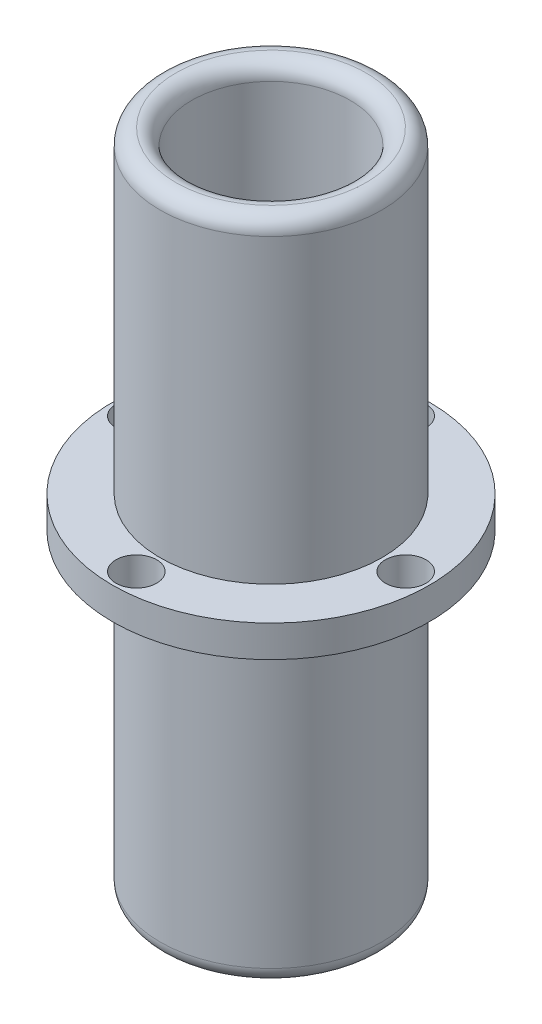
ISO-10303-21;
HEADER;
FILE_DESCRIPTION(('STEP AP214'),'2;1');
FILE_NAME('part.step','',(''),(''),'','','');
FILE_SCHEMA(('AUTOMOTIVE_DESIGN { 1 0 10303 214 1 1 1 1 }'));
ENDSEC;
DATA;
#1=APPLICATION_CONTEXT('core data for automotive mechanical design processes');
#2=APPLICATION_PROTOCOL_DEFINITION('international standard','automotive_design',2000,#1);
#3=PRODUCT_CONTEXT('',#1,'mechanical');
#4=PRODUCT('Part','Part','',(#3));
#5=PRODUCT_RELATED_PRODUCT_CATEGORY('part','',(#4));
#6=PRODUCT_DEFINITION_FORMATION('','',#4);
#7=PRODUCT_DEFINITION_CONTEXT('part definition',#1,'design');
#8=PRODUCT_DEFINITION('design','',#6,#7);
#9=PRODUCT_DEFINITION_SHAPE('','',#8);
#10=(LENGTH_UNIT() NAMED_UNIT(*) SI_UNIT(.MILLI.,.METRE.));
#11=(NAMED_UNIT(*) PLANE_ANGLE_UNIT() SI_UNIT($,.RADIAN.));
#12=(NAMED_UNIT(*) SI_UNIT($,.STERADIAN.) SOLID_ANGLE_UNIT());
#13=UNCERTAINTY_MEASURE_WITH_UNIT(LENGTH_MEASURE(1.E-05),#10,'distance_accuracy_value','');
#14=(GEOMETRIC_REPRESENTATION_CONTEXT(3) GLOBAL_UNCERTAINTY_ASSIGNED_CONTEXT((#13)) GLOBAL_UNIT_ASSIGNED_CONTEXT((#10,
#11,#12)) REPRESENTATION_CONTEXT('',''));
#15=CARTESIAN_POINT('',(0.,0.,0.));
#16=DIRECTION('',(0.,0.,1.));
#17=DIRECTION('',(1.,0.,0.));
#18=AXIS2_PLACEMENT_3D('',#15,#16,#17);
#19=CARTESIAN_POINT('',(0.,27.94,0.));
#20=DIRECTION('',(0.,1.,0.));
#21=DIRECTION('',(0.,0.,1.));
#22=AXIS2_PLACEMENT_3D('',#19,#20,#21);
#23=PLANE('',#22);
#24=CARTESIAN_POINT('',(10.795,27.94,0.));
#25=DIRECTION('',(0.,1.,0.));
#26=DIRECTION('',(0.,0.,1.));
#27=AXIS2_PLACEMENT_3D('',#24,#25,#26);
#28=CIRCLE('',#27,1.63195);
#29=CARTESIAN_POINT('',(10.795,27.94,1.63195));
#30=VERTEX_POINT('',#29);
#31=EDGE_CURVE('E61',#30,#30,#28,.T.);
#32=ORIENTED_EDGE('',*,*,#31,.F.);
#33=EDGE_LOOP('',(#32));
#34=FACE_BOUND('',#33,.T.);
#35=CARTESIAN_POINT('',(0.,27.94,-10.795));
#36=DIRECTION('',(0.,1.,0.));
#37=DIRECTION('',(0.,0.,1.));
#38=AXIS2_PLACEMENT_3D('',#35,#36,#37);
#39=CIRCLE('',#38,1.63195);
#40=CARTESIAN_POINT('',(0.,27.94,-9.16305));
#41=VERTEX_POINT('',#40);
#42=EDGE_CURVE('E71',#41,#41,#39,.T.);
#43=ORIENTED_EDGE('',*,*,#42,.F.);
#44=EDGE_LOOP('',(#43));
#45=FACE_BOUND('',#44,.T.);
#46=CARTESIAN_POINT('',(0.,27.94,10.795));
#47=DIRECTION('',(0.,1.,0.));
#48=DIRECTION('',(0.,0.,1.));
#49=AXIS2_PLACEMENT_3D('',#46,#47,#48);
#50=CIRCLE('',#49,1.63195);
#51=CARTESIAN_POINT('',(0.,27.94,12.42695));
#52=VERTEX_POINT('',#51);
#53=EDGE_CURVE('E75',#52,#52,#50,.T.);
#54=ORIENTED_EDGE('',*,*,#53,.F.);
#55=EDGE_LOOP('',(#54));
#56=FACE_BOUND('',#55,.T.);
#57=CARTESIAN_POINT('',(-10.795,27.94,0.));
#58=DIRECTION('',(0.,1.,0.));
#59=DIRECTION('',(0.,0.,1.));
#60=AXIS2_PLACEMENT_3D('',#57,#58,#59);
#61=CIRCLE('',#60,1.63195);
#62=CARTESIAN_POINT('',(-10.795,27.94,1.63195));
#63=VERTEX_POINT('',#62);
#64=EDGE_CURVE('E79',#63,#63,#61,.T.);
#65=ORIENTED_EDGE('',*,*,#64,.F.);
#66=EDGE_LOOP('',(#65));
#67=FACE_BOUND('',#66,.T.);
#68=CARTESIAN_POINT('',(0.,27.94,0.));
#69=DIRECTION('',(0.,1.,0.));
#70=DIRECTION('',(0.,0.,1.));
#71=AXIS2_PLACEMENT_3D('',#68,#69,#70);
#72=CIRCLE('',#71,12.7);
#73=CARTESIAN_POINT('',(0.,27.94,12.7));
#74=VERTEX_POINT('',#73);
#75=EDGE_CURVE('E169',#74,#74,#72,.T.);
#76=ORIENTED_EDGE('',*,*,#75,.T.);
#77=EDGE_LOOP('',(#76));
#78=FACE_BOUND('',#77,.T.);
#79=CARTESIAN_POINT('',(0.,27.94,0.));
#80=DIRECTION('',(0.,1.,0.));
#81=DIRECTION('',(1.,0.,0.));
#82=AXIS2_PLACEMENT_3D('',#79,#80,#81);
#83=CIRCLE('',#82,8.89);
#84=CARTESIAN_POINT('',(8.89,27.94,0.));
#85=VERTEX_POINT('',#84);
#86=EDGE_CURVE('E108',#85,#85,#83,.T.);
#87=ORIENTED_EDGE('',*,*,#86,.F.);
#88=EDGE_LOOP('',(#87));
#89=FACE_BOUND('',#88,.T.);
#90=ADVANCED_FACE('F43',(#34,#45,#56,#67,#78,#89),#23,.T.);
#91=CARTESIAN_POINT('',(0.,25.4,0.));
#92=DIRECTION('',(0.,-1.,0.));
#93=DIRECTION('',(0.,0.,-1.));
#94=AXIS2_PLACEMENT_3D('',#91,#92,#93);
#95=CYLINDRICAL_SURFACE('',#94,8.89);
#96=CARTESIAN_POINT('',(0.,1.27,0.));
#97=DIRECTION('',(0.,1.,0.));
#98=DIRECTION('',(0.,0.,1.));
#99=AXIS2_PLACEMENT_3D('',#96,#97,#98);
#100=CIRCLE('',#99,8.89);
#101=CARTESIAN_POINT('',(0.,1.27,8.89));
#102=VERTEX_POINT('',#101);
#103=EDGE_CURVE('E55',#102,#102,#100,.T.);
#104=ORIENTED_EDGE('',*,*,#103,.T.);
#105=EDGE_LOOP('',(#104));
#106=FACE_BOUND('',#105,.T.);
#107=CARTESIAN_POINT('',(0.,25.4,0.));
#108=DIRECTION('',(0.,1.,0.));
#109=DIRECTION('',(1.,0.,0.));
#110=AXIS2_PLACEMENT_3D('',#107,#108,#109);
#111=CIRCLE('',#110,8.89);
#112=CARTESIAN_POINT('',(8.89,25.4,0.));
#113=VERTEX_POINT('',#112);
#114=EDGE_CURVE('E67',#113,#113,#111,.T.);
#115=ORIENTED_EDGE('',*,*,#114,.F.);
#116=EDGE_LOOP('',(#115));
#117=FACE_BOUND('',#116,.T.);
#118=ADVANCED_FACE('F117',(#106,#117),#95,.T.);
#119=CARTESIAN_POINT('',(0.,25.4,0.));
#120=DIRECTION('',(0.,-1.,0.));
#121=DIRECTION('',(0.,0.,-1.));
#122=AXIS2_PLACEMENT_3D('',#119,#120,#121);
#123=CYLINDRICAL_SURFACE('',#122,6.35);
#124=CARTESIAN_POINT('',(0.,52.07,0.));
#125=DIRECTION('',(0.,1.,0.));
#126=DIRECTION('',(0.,0.,1.));
#127=AXIS2_PLACEMENT_3D('',#124,#125,#126);
#128=CIRCLE('',#127,6.35);
#129=CARTESIAN_POINT('',(0.,52.07,6.35));
#130=VERTEX_POINT('',#129);
#131=EDGE_CURVE('E51',#130,#130,#128,.T.);
#132=ORIENTED_EDGE('',*,*,#131,.T.);
#133=EDGE_LOOP('',(#132));
#134=FACE_BOUND('',#133,.T.);
#135=CARTESIAN_POINT('',(0.,1.27,0.));
#136=DIRECTION('',(0.,1.,0.));
#137=DIRECTION('',(0.,0.,1.));
#138=AXIS2_PLACEMENT_3D('',#135,#136,#137);
#139=CIRCLE('',#138,6.35);
#140=CARTESIAN_POINT('',(0.,1.27,6.35));
#141=VERTEX_POINT('',#140);
#142=EDGE_CURVE('E64',#141,#141,#139,.F.);
#143=ORIENTED_EDGE('',*,*,#142,.T.);
#144=EDGE_LOOP('',(#143));
#145=FACE_BOUND('',#144,.T.);
#146=CARTESIAN_POINT('',(0.,43.4975,-6.35));
#147=CARTESIAN_POINT('',(-0.104215878901762,43.4975042852671,-6.35000402015475));
#148=CARTESIAN_POINT('',(-0.208395387311675,43.493550379238,-6.3474309237195));
#149=CARTESIAN_POINT('',(-0.415939601810196,43.4778061808033,-6.33721356548535));
#150=CARTESIAN_POINT('',(-0.519304193474166,43.4660148070709,-6.32956860392713));
#151=CARTESIAN_POINT('',(-0.724430327915423,43.4347541181221,-6.3093840608237));
#152=CARTESIAN_POINT('',(-0.826191040874159,43.4152809558637,-6.29684202685537));
#153=CARTESIAN_POINT('',(-1.02734576530779,43.3689359931229,-6.26717012400427));
#154=CARTESIAN_POINT('',(-1.12673878139565,43.342061138571,-6.25003836139775));
#155=CARTESIAN_POINT('',(-1.41934393694361,43.2511342241915,-6.19251233655024));
#156=CARTESIAN_POINT('',(-1.60819045039433,43.176590563603,-6.14586161492557));
#157=CARTESIAN_POINT('',(-1.9698814468998,43.0026584926246,-6.03967905932119));
#158=CARTESIAN_POINT('',(-2.14272433909919,42.903267615899,-5.98014594671374));
#159=CARTESIAN_POINT('',(-2.48381082203452,42.6734322762727,-5.84716909724718));
#160=CARTESIAN_POINT('',(-2.65048413068498,42.5410960209458,-5.77298116565329));
#161=CARTESIAN_POINT('',(-2.96082247758218,42.2535107642551,-5.62014124222538));
#162=CARTESIAN_POINT('',(-3.10445497625085,42.0982299431587,-5.54148314587608));
#163=CARTESIAN_POINT('',(-3.31091795536365,41.8375476821753,-5.41922641672158));
#164=CARTESIAN_POINT('',(-3.38213827018749,41.7390098231587,-5.37494083186607));
#165=CARTESIAN_POINT('',(-3.51596925345143,41.5354292384951,-5.28836600023759));
#166=CARTESIAN_POINT('',(-3.57857810651669,41.4303851480233,-5.24607717563009));
#167=CARTESIAN_POINT('',(-3.75257099439148,41.1062050230306,-5.12451471705546));
#168=CARTESIAN_POINT('',(-3.85053921485784,40.877497188289,-5.05028504185224));
#169=CARTESIAN_POINT('',(-3.98344899880532,40.466052112049,-4.94567963850388));
#170=CARTESIAN_POINT('',(-4.02833214592338,40.2881314150347,-4.9088518723849));
#171=CARTESIAN_POINT('',(-4.09413274736222,39.925160629553,-4.85411713859071));
#172=CARTESIAN_POINT('',(-4.11508842135289,39.7401224001835,-4.83618000023458));
#173=CARTESIAN_POINT('',(-4.13172579477583,39.3674107750774,-4.82198004649956));
#174=CARTESIAN_POINT('',(-4.12732057295081,39.1797305184834,-4.82579177219918));
#175=CARTESIAN_POINT('',(-4.09335499925978,38.8082600265679,-4.85462624876857));
#176=CARTESIAN_POINT('',(-4.0637735982931,38.6244731782329,-4.87966674835565));
#177=CARTESIAN_POINT('',(-3.98274390194248,38.2719927405509,-4.94599170479986));
#178=CARTESIAN_POINT('',(-3.93209368922686,38.1029963554124,-4.9866795767372));
#179=CARTESIAN_POINT('',(-3.81114913007929,37.7756725445764,-5.07970957885252));
#180=CARTESIAN_POINT('',(-3.74084831601446,37.6173486528633,-5.13205554492228));
#181=CARTESIAN_POINT('',(-3.56669363572688,37.2825980346055,-5.25496449601859));
#182=CARTESIAN_POINT('',(-3.45895581253425,37.1087670199881,-5.32708377658083));
#183=CARTESIAN_POINT('',(-3.21990581067058,36.7796525641942,-5.47489787098286));
#184=CARTESIAN_POINT('',(-3.08856516322942,36.6243919027059,-5.55059692043957));
#185=CARTESIAN_POINT('',(-2.77611617950891,36.3059527241501,-5.71423679855898));
#186=CARTESIAN_POINT('',(-2.59029646673285,36.147099255467,-5.80169771829896));
#187=CARTESIAN_POINT('',(-2.18993870953621,35.862791012737,-5.96432760538528));
#188=CARTESIAN_POINT('',(-1.97543048700492,35.7373019555697,-6.03950915933029));
#189=CARTESIAN_POINT('',(-1.56714443002327,35.5463155959534,-6.15648689042275));
#190=CARTESIAN_POINT('',(-1.37767353063626,35.4738592830426,-6.20194606539541));
#191=CARTESIAN_POINT('',(-0.987113726560393,35.3571075039902,-6.27594563940463));
#192=CARTESIAN_POINT('',(-0.786034518910541,35.3127888938915,-6.3044999418084));
#193=CARTESIAN_POINT('',(-0.37691031104976,35.254538057414,-6.34214228882736));
#194=CARTESIAN_POINT('',(-0.16884240665583,35.2407182148237,-6.35115833544721));
#195=CARTESIAN_POINT('',(0.24687843491818,35.2446506378759,-6.34860191338949));
#196=CARTESIAN_POINT('',(0.454531365089846,35.2624034323054,-6.33702909988419));
#197=CARTESIAN_POINT('',(0.850633949588132,35.3264179773925,-6.29573317809554));
#198=CARTESIAN_POINT('',(1.03949185382523,35.370925058469,-6.26712813716595));
#199=CARTESIAN_POINT('',(1.40651641130271,35.4847824192578,-6.19509652693824));
#200=CARTESIAN_POINT('',(1.58468132608709,35.5541367259029,-6.15166755521355));
#201=CARTESIAN_POINT('',(1.93902105249202,35.7206959898374,-6.04971256869142));
#202=CARTESIAN_POINT('',(2.11419539634189,35.8195026397212,-5.99034654934882));
#203=CARTESIAN_POINT('',(2.446229241541,36.0395415981251,-5.86260781666531));
#204=CARTESIAN_POINT('',(2.60307538412418,36.1607900994276,-5.79422861023426));
#205=CARTESIAN_POINT('',(2.91965059843049,36.4436198794645,-5.64212257056875));
#206=CARTESIAN_POINT('',(3.07604730779348,36.6085403955285,-5.55766107370454));
#207=CARTESIAN_POINT('',(3.36024953397264,36.9624066951826,-5.39058458331544));
#208=CARTESIAN_POINT('',(3.48804341229204,37.1513622097505,-5.30797035370614));
#209=CARTESIAN_POINT('',(3.69886372671026,37.527339777181,-5.16287603942624));
#210=CARTESIAN_POINT('',(3.78541215893535,37.7119029869648,-5.09916975552889));
#211=CARTESIAN_POINT('',(3.93127746140992,38.0959089467347,-4.98758894599005));
#212=CARTESIAN_POINT('',(3.99064338350806,38.2953241333839,-4.93968594676155));
#213=CARTESIAN_POINT('',(4.07229670801227,38.6740764906294,-4.87250341374757));
#214=CARTESIAN_POINT('',(4.09882245951256,38.8519130093284,-4.84999907804117));
#215=CARTESIAN_POINT('',(4.12835277182942,39.2108774189332,-4.82489563210176));
#216=CARTESIAN_POINT('',(4.13137550154871,39.3920026589095,-4.82228114614578));
#217=CARTESIAN_POINT('',(4.11372966833684,39.7520588770973,-4.8373379340038));
#218=CARTESIAN_POINT('',(4.09307859937785,39.9309913769561,-4.85499422855165));
#219=CARTESIAN_POINT('',(4.02940487189793,40.2821981799132,-4.90795932743229));
#220=CARTESIAN_POINT('',(3.98635343167915,40.4544636099845,-4.94329083997146));
#221=CARTESIAN_POINT('',(3.86426340787444,40.8380821133884,-5.03960389996224));
#222=CARTESIAN_POINT('',(3.77837942733058,41.0461157689118,-5.1050663924388));
#223=CARTESIAN_POINT('',(3.57650543671083,41.4423097692529,-5.24846771626179));
#224=CARTESIAN_POINT('',(3.46047427019613,41.6304424476427,-5.32642354712018));
#225=CARTESIAN_POINT('',(3.19907662656865,41.9876123275523,-5.48747438696928));
#226=CARTESIAN_POINT('',(3.05328301718928,42.1563080486308,-5.57063035726654));
#227=CARTESIAN_POINT('',(2.73530560010551,42.4690353385453,-5.73345040109777));
#228=CARTESIAN_POINT('',(2.56311547118666,42.6130609820619,-5.81311363232823));
#229=CARTESIAN_POINT('',(2.27754975825177,42.814480125104,-5.92851465213372));
#230=CARTESIAN_POINT('',(2.17248158100595,42.8817351038253,-5.96791436374954));
#231=CARTESIAN_POINT('',(1.95556571968979,43.0069885932976,-6.04246554306546));
#232=CARTESIAN_POINT('',(1.84372148962251,43.0649917661599,-6.07761914825487));
#233=CARTESIAN_POINT('',(1.61408176209726,43.1709152317686,-6.14259348139466));
#234=CARTESIAN_POINT('',(1.49629571363306,43.2188509441513,-6.17242235419949));
#235=CARTESIAN_POINT('',(1.25559603454128,43.3039581120944,-6.22584735589874));
#236=CARTESIAN_POINT('',(1.13268491636457,43.3411347726832,-6.24944649813334));
#237=CARTESIAN_POINT('',(0.844498980423357,43.4136833912319,-6.29576065231066));
#238=CARTESIAN_POINT('',(0.67777745941442,43.4450162971081,-6.31599180898108));
#239=CARTESIAN_POINT('',(0.340670858393444,43.4869180313645,-6.34310622546941));
#240=CARTESIAN_POINT('',(0.170286876456433,43.4974929979505,-6.34999343113926));
#241=CARTESIAN_POINT('',(0.,43.4975,-6.35));
#242=B_SPLINE_CURVE_WITH_KNOTS('',3,(#146,#147,#148,#149,#150,#151,#152,#153,#154,#155,#156,
#157,#158,#159,#160,#161,#162,#163,#164,#165,#166,#167,#168,#169,#170,#171,#172,#173,#174,#175,
#176,#177,#178,#179,#180,#181,#182,#183,#184,#185,#186,#187,#188,#189,#190,#191,#192,#193,#194,
#195,#196,#197,#198,#199,#200,#201,#202,#203,#204,#205,#206,#207,#208,#209,#210,#211,#212,#213,
#214,#215,#216,#217,#218,#219,#220,#221,#222,#223,#224,#225,#226,#227,#228,#229,#230,#231,#232,
#233,#234,#235,#236,#237,#238,#239,#240,#241),.UNSPECIFIED.,.T.,.F.,(4,2,2,2,2,2,2,2,2,2,2,2,2,
2,2,2,2,2,2,2,2,2,2,2,2,2,2,2,2,2,2,2,2,2,2,2,2,2,2,2,2,2,2,2,2,2,2,4),(0.,0.312478411138086,
0.624999943527046,0.937678185890843,1.25048563863393,1.87245971339086,2.49449554984877,
3.16811971485717,3.84268699156936,4.23044228831533,4.61827920254606,5.39182342464974,
5.95107792974386,6.50943787501695,7.06971266502209,7.63045634583043,8.17165590375383,
8.71303379769264,9.36127776676809,10.0103089344297,10.7854717576504,11.5598349679368,
12.1808504902553,12.801354547911,13.4241412870253,14.0469384568367,14.6327699663649,
15.218696463246,15.8453793196663,16.4725161306521,17.1970096782021,17.9217974885208,
18.5601147943524,19.1972756488165,19.7384547014401,20.2792153564557,20.8195766688342,
21.3606339992553,22.0600747966775,22.7604755226853,23.4717409354237,24.183176942809,
24.5751675259667,24.9669599513803,25.3581478470585,25.7491461757684,26.2598813427955,
26.7704654606239),.UNSPECIFIED.);
#243=CARTESIAN_POINT('',(0.,43.4975,-6.35));
#244=VERTEX_POINT('',#243);
#245=EDGE_CURVE('E87',#244,#244,#242,.T.);
#246=ORIENTED_EDGE('',*,*,#245,.F.);
#247=EDGE_LOOP('',(#246));
#248=FACE_BOUND('',#247,.T.);
#249=ADVANCED_FACE('F111',(#134,#145,#248),#123,.F.);
#250=CARTESIAN_POINT('',(0.,25.4,0.));
#251=DIRECTION('',(0.,1.,0.));
#252=DIRECTION('',(0.,0.,1.));
#253=AXIS2_PLACEMENT_3D('',#250,#251,#252);
#254=PLANE('',#253);
#255=CARTESIAN_POINT('',(10.795,25.4,0.));
#256=DIRECTION('',(0.,1.,0.));
#257=DIRECTION('',(0.,0.,1.));
#258=AXIS2_PLACEMENT_3D('',#255,#256,#257);
#259=CIRCLE('',#258,1.63194999999999);
#260=CARTESIAN_POINT('',(10.795,25.4,1.63194999999999));
#261=VERTEX_POINT('',#260);
#262=EDGE_CURVE('E68',#261,#261,#259,.T.);
#263=ORIENTED_EDGE('',*,*,#262,.T.);
#264=EDGE_LOOP('',(#263));
#265=FACE_BOUND('',#264,.T.);
#266=CARTESIAN_POINT('',(0.,25.4,-10.795));
#267=DIRECTION('',(0.,1.,0.));
#268=DIRECTION('',(0.,0.,1.));
#269=AXIS2_PLACEMENT_3D('',#266,#267,#268);
#270=CIRCLE('',#269,1.63195);
#271=CARTESIAN_POINT('',(0.,25.4,-9.16305));
#272=VERTEX_POINT('',#271);
#273=EDGE_CURVE('E72',#272,#272,#270,.T.);
#274=ORIENTED_EDGE('',*,*,#273,.T.);
#275=EDGE_LOOP('',(#274));
#276=FACE_BOUND('',#275,.T.);
#277=CARTESIAN_POINT('',(0.,25.4,10.795));
#278=DIRECTION('',(0.,1.,0.));
#279=DIRECTION('',(0.,0.,1.));
#280=AXIS2_PLACEMENT_3D('',#277,#278,#279);
#281=CIRCLE('',#280,1.63195);
#282=CARTESIAN_POINT('',(0.,25.4,12.42695));
#283=VERTEX_POINT('',#282);
#284=EDGE_CURVE('E76',#283,#283,#281,.T.);
#285=ORIENTED_EDGE('',*,*,#284,.T.);
#286=EDGE_LOOP('',(#285));
#287=FACE_BOUND('',#286,.T.);
#288=CARTESIAN_POINT('',(-10.795,25.4,0.));
#289=DIRECTION('',(0.,1.,0.));
#290=DIRECTION('',(0.,0.,1.));
#291=AXIS2_PLACEMENT_3D('',#288,#289,#290);
#292=CIRCLE('',#291,1.63194999999999);
#293=CARTESIAN_POINT('',(-10.795,25.4,1.63194999999999));
#294=VERTEX_POINT('',#293);
#295=EDGE_CURVE('E88',#294,#294,#292,.T.);
#296=ORIENTED_EDGE('',*,*,#295,.T.);
#297=EDGE_LOOP('',(#296));
#298=FACE_BOUND('',#297,.T.);
#299=CARTESIAN_POINT('',(0.,25.4,0.));
#300=DIRECTION('',(0.,1.,0.));
#301=DIRECTION('',(0.,0.,1.));
#302=AXIS2_PLACEMENT_3D('',#299,#300,#301);
#303=CIRCLE('',#302,12.7);
#304=CARTESIAN_POINT('',(0.,25.4,12.7));
#305=VERTEX_POINT('',#304);
#306=EDGE_CURVE('E165',#305,#305,#303,.T.);
#307=ORIENTED_EDGE('',*,*,#306,.F.);
#308=EDGE_LOOP('',(#307));
#309=FACE_BOUND('',#308,.T.);
#310=ORIENTED_EDGE('',*,*,#114,.T.);
#311=EDGE_LOOP('',(#310));
#312=FACE_BOUND('',#311,.T.);
#313=ADVANCED_FACE('F116',(#265,#276,#287,#298,#309,#312),#254,.F.);
#314=CARTESIAN_POINT('',(0.,27.94,0.));
#315=DIRECTION('',(0.,-1.,0.));
#316=DIRECTION('',(0.,0.,-1.));
#317=AXIS2_PLACEMENT_3D('',#314,#315,#316);
#318=CYLINDRICAL_SURFACE('',#317,12.7);
#319=ORIENTED_EDGE('',*,*,#75,.F.);
#320=EDGE_LOOP('',(#319));
#321=FACE_BOUND('',#320,.T.);
#322=ORIENTED_EDGE('',*,*,#306,.T.);
#323=EDGE_LOOP('',(#322));
#324=FACE_BOUND('',#323,.T.);
#325=ADVANCED_FACE('F119',(#321,#324),#318,.T.);
#326=CARTESIAN_POINT('',(0.,53.34,0.));
#327=DIRECTION('',(0.,-1.,0.));
#328=DIRECTION('',(0.,0.,-1.));
#329=AXIS2_PLACEMENT_3D('',#326,#327,#328);
#330=CYLINDRICAL_SURFACE('',#329,8.89);
#331=CARTESIAN_POINT('',(0.,52.07,0.));
#332=DIRECTION('',(0.,1.,0.));
#333=DIRECTION('',(0.,0.,1.));
#334=AXIS2_PLACEMENT_3D('',#331,#332,#333);
#335=CIRCLE('',#334,8.89);
#336=CARTESIAN_POINT('',(0.,52.07,8.89));
#337=VERTEX_POINT('',#336);
#338=EDGE_CURVE('E11',#337,#337,#335,.F.);
#339=ORIENTED_EDGE('',*,*,#338,.T.);
#340=EDGE_LOOP('',(#339));
#341=FACE_BOUND('',#340,.T.);
#342=CARTESIAN_POINT('',(0.,43.4975,-8.89));
#343=CARTESIAN_POINT('',(-0.10945431316074,43.497499187807,-8.88999931572162));
#344=CARTESIAN_POINT('',(-0.218929872409133,43.4931404498909,-8.8879732975639));
#345=CARTESIAN_POINT('',(-0.437084977057431,43.4757519134159,-8.87992034600662));
#346=CARTESIAN_POINT('',(-0.545764074524213,43.4627175651628,-8.87389131333618));
#347=CARTESIAN_POINT('',(-0.761663556669059,43.4280896344232,-8.85797359201736));
#348=CARTESIAN_POINT('',(-0.868881095825045,43.406481298865,-8.84807825114869));
#349=CARTESIAN_POINT('',(-1.08091166156907,43.354948325628,-8.82468916735058));
#350=CARTESIAN_POINT('',(-1.18572368608007,43.3250202878791,-8.81119395332743));
#351=CARTESIAN_POINT('',(-1.49461848127882,43.2234556514359,-8.76591325359487));
#352=CARTESIAN_POINT('',(-1.69420515658253,43.1398678094897,-8.72925078689283));
#353=CARTESIAN_POINT('',(-2.07617352995036,42.9437872423844,-8.64638285663524));
#354=CARTESIAN_POINT('',(-2.25855821590003,42.8312995496484,-8.60017905481735));
#355=CARTESIAN_POINT('',(-2.61224074573337,42.5735689194757,-8.49963991669751));
#356=CARTESIAN_POINT('',(-2.78239901386912,42.4268791735315,-8.44499928960073));
#357=CARTESIAN_POINT('',(-3.09670172572479,42.1080496110843,-8.33488672253737));
#358=CARTESIAN_POINT('',(-3.24082922359094,41.9358933477338,-8.27941426631817));
#359=CARTESIAN_POINT('',(-3.50830745305871,41.5574602831231,-8.16983007473513));
#360=CARTESIAN_POINT('',(-3.62972282547989,41.3497002387213,-8.11603594471024));
#361=CARTESIAN_POINT('',(-3.78390985417095,41.0231286775489,-8.04470838574985));
#362=CARTESIAN_POINT('',(-3.83066124868856,40.9117403762586,-8.02248686517781));
#363=CARTESIAN_POINT('',(-3.91439353846056,40.6846824520922,-7.98196646338299));
#364=CARTESIAN_POINT('',(-3.95137986839537,40.5690152516512,-7.96366540132995));
#365=CARTESIAN_POINT('',(-4.01337114562992,40.3407336412882,-7.93259657952784));
#366=CARTESIAN_POINT('',(-4.03892326389141,40.2283013172016,-7.91957981391399));
#367=CARTESIAN_POINT('',(-4.08056477396377,40.0013090382207,-7.89820492379641));
#368=CARTESIAN_POINT('',(-4.09665887361282,39.8867501711825,-7.88984448166232));
#369=CARTESIAN_POINT('',(-4.11917023237063,39.6564790013149,-7.87811518660831));
#370=CARTESIAN_POINT('',(-4.12559162303457,39.540767212211,-7.87474420252556));
#371=CARTESIAN_POINT('',(-4.12867611204991,39.3091834933901,-7.87312753190038));
#372=CARTESIAN_POINT('',(-4.12533993253642,39.1933115761581,-7.87488146607464));
#373=CARTESIAN_POINT('',(-4.10977805748837,38.9739838385986,-7.88301284111991));
#374=CARTESIAN_POINT('',(-4.09847353144754,38.8704438416372,-7.88891098738152));
#375=CARTESIAN_POINT('',(-4.06813923863795,38.6647902583174,-7.90459514205421));
#376=CARTESIAN_POINT('',(-4.04910699869873,38.5626771394482,-7.91438239511003));
#377=CARTESIAN_POINT('',(-3.98070035594559,38.259552233787,-7.94913940386285));
#378=CARTESIAN_POINT('',(-3.92000388097967,38.0615887974075,-7.97951132149816));
#379=CARTESIAN_POINT('',(-3.76900169102521,37.6743730923898,-8.05194504896118));
#380=CARTESIAN_POINT('',(-3.67804679135136,37.4854260897256,-8.09425976726198));
#381=CARTESIAN_POINT('',(-3.46956815028538,37.1246071237733,-8.18578939225453));
#382=CARTESIAN_POINT('',(-3.35203283673131,36.9527426446588,-8.23500730079328));
#383=CARTESIAN_POINT('',(-3.07897850696712,36.6115822427625,-8.34120176637698));
#384=CARTESIAN_POINT('',(-2.92073651537195,36.444542329018,-8.39844404708643));
#385=CARTESIAN_POINT('',(-2.57808200636346,36.1385087616483,-8.50987919539664));
#386=CARTESIAN_POINT('',(-2.3936601397755,35.9995251704329,-8.5640709639228));
#387=CARTESIAN_POINT('',(-1.99560423667331,35.7490911789917,-8.66563603864379));
#388=CARTESIAN_POINT('',(-1.78117492550491,35.6387718769145,-8.7127051163213));
#389=CARTESIAN_POINT('',(-1.33405467183408,35.4565980017344,-8.79225831600248));
#390=CARTESIAN_POINT('',(-1.10137642036698,35.3847169643992,-8.82475247015527));
#391=CARTESIAN_POINT('',(-0.643010533436432,35.2866730458851,-8.86947903289634));
#392=CARTESIAN_POINT('',(-0.418097865176179,35.2574976324202,-8.88304300788639));
#393=CARTESIAN_POINT('',(0.0338077491213384,35.2364520314945,-8.89280355878528));
#394=CARTESIAN_POINT('',(0.260799866023202,35.2445675703959,-8.88900677977019));
#395=CARTESIAN_POINT('',(0.694880992882192,35.2959260503026,-8.86529614285537));
#396=CARTESIAN_POINT('',(0.902307948612797,35.3368638982812,-8.84644020886892));
#397=CARTESIAN_POINT('',(1.3070169322847,35.4492748648819,-8.79576156924804));
#398=CARTESIAN_POINT('',(1.50429776464814,35.5207515728845,-8.76393733940716));
#399=CARTESIAN_POINT('',(1.89003930630686,35.6943867482404,-8.68905418586489));
#400=CARTESIAN_POINT('',(2.07804258596368,35.7974206792952,-8.64568003349507));
#401=CARTESIAN_POINT('',(2.43476297473812,36.0302995954209,-8.55208104222546));
#402=CARTESIAN_POINT('',(2.60347155710982,36.1601563634985,-8.50185319586811));
#403=CARTESIAN_POINT('',(2.93231147135472,36.456080389106,-8.39441015413957));
#404=CARTESIAN_POINT('',(3.09041780791267,36.6243157259042,-8.33696731811174));
#405=CARTESIAN_POINT('',(3.37697270726864,36.9855882841212,-8.22507542930459));
#406=CARTESIAN_POINT('',(3.50540752550344,37.1786369354822,-8.17062777282635));
#407=CARTESIAN_POINT('',(3.67476573934937,37.4867274938033,-8.09519529896576));
#408=CARTESIAN_POINT('',(3.72797063063417,37.5943391246196,-8.07076257332577));
#409=CARTESIAN_POINT('',(3.82500987905556,37.8143682677002,-8.025227157758));
#410=CARTESIAN_POINT('',(3.86884843038793,37.9267836017164,-8.00412297843847));
#411=CARTESIAN_POINT('',(3.94664744231655,38.1555766061189,-7.96604997802088));
#412=CARTESIAN_POINT('',(3.98061452055788,38.2719515633161,-7.94907838775804));
#413=CARTESIAN_POINT('',(4.03826884113298,38.5078100242997,-7.91994520017875));
#414=CARTESIAN_POINT('',(4.06195739509794,38.6272931293948,-7.90778298916026));
#415=CARTESIAN_POINT('',(4.09706093228227,38.8574922243627,-7.88964793215074));
#416=CARTESIAN_POINT('',(4.10938568860289,38.968034145415,-7.88321804102716));
#417=CARTESIAN_POINT('',(4.12506921431241,39.1899199354527,-7.87502273844694));
#418=CARTESIAN_POINT('',(4.1284286718111,39.3012637422336,-7.87325696900705));
#419=CARTESIAN_POINT('',(4.12613291678941,39.523812595249,-7.87446073796848));
#420=CARTESIAN_POINT('',(4.12047976689563,39.6350176674056,-7.87742919289459));
#421=CARTESIAN_POINT('',(4.10025345057628,39.8563613090696,-7.88797423903655));
#422=CARTESIAN_POINT('',(4.08568048827361,39.966499902924,-7.89555072480121));
#423=CARTESIAN_POINT('',(4.03154134346973,40.2783713630159,-7.9234102142982));
#424=CARTESIAN_POINT('',(3.98125914288954,40.4778832420673,-7.94901863847823));
#425=CARTESIAN_POINT('',(3.85250041615649,40.865429308996,-8.01220346795724));
#426=CARTESIAN_POINT('',(3.77401552327134,41.0534600714489,-8.04978342440676));
#427=CARTESIAN_POINT('',(3.58518344950887,41.4265120870524,-8.13572341005127));
#428=CARTESIAN_POINT('',(3.47307397841679,41.6105140196002,-8.18463156655353));
#429=CARTESIAN_POINT('',(3.22233012284425,41.958211377352,-8.28655430140787));
#430=CARTESIAN_POINT('',(3.08368348258766,42.1218973621489,-8.33957077036043));
#431=CARTESIAN_POINT('',(2.76767357203501,42.4410825501195,-8.45001731264929));
#432=CARTESIAN_POINT('',(2.58783708093262,42.5941700345784,-8.50736517665633));
#433=CARTESIAN_POINT('',(2.20300267802828,42.8683949003317,-8.61502526156805));
#434=CARTESIAN_POINT('',(1.99799293549769,42.9895171740032,-8.66533415040412));
#435=CARTESIAN_POINT('',(1.67633826346815,43.1436239560812,-8.7312071100795));
#436=CARTESIAN_POINT('',(1.56704415546889,43.190317014183,-8.75152876934722));
#437=CARTESIAN_POINT('',(1.34430553835969,43.2742585718765,-8.78849526128199));
#438=CARTESIAN_POINT('',(1.23086307602103,43.3115116590213,-8.80514187940436));
#439=CARTESIAN_POINT('',(1.00095329745599,43.3760678917187,-8.83422873581412));
#440=CARTESIAN_POINT('',(0.884493695186014,43.4033941563745,-8.84667874286717));
#441=CARTESIAN_POINT('',(0.649311700460251,43.4478613585057,-8.86704026338321));
#442=CARTESIAN_POINT('',(0.530590869041063,43.4650090772019,-8.87495479837774));
#443=CARTESIAN_POINT('',(0.342995448957589,43.4837968538933,-8.88364430979922));
#444=CARTESIAN_POINT('',(0.274524086196724,43.4889328366326,-8.88602512794029));
#445=CARTESIAN_POINT('',(0.137371274127361,43.4957846971665,-8.88920320286302));
#446=CARTESIAN_POINT('',(0.0686898208354032,43.4975005097048,-8.89000042942994));
#447=CARTESIAN_POINT('',(0.,43.4975,-8.89));
#448=B_SPLINE_CURVE_WITH_KNOTS('',3,(#342,#343,#344,#345,#346,#347,#348,#349,#350,#351,#352,
#353,#354,#355,#356,#357,#358,#359,#360,#361,#362,#363,#364,#365,#366,#367,#368,#369,#370,#371,
#372,#373,#374,#375,#376,#377,#378,#379,#380,#381,#382,#383,#384,#385,#386,#387,#388,#389,#390,
#391,#392,#393,#394,#395,#396,#397,#398,#399,#400,#401,#402,#403,#404,#405,#406,#407,#408,#409,
#410,#411,#412,#413,#414,#415,#416,#417,#418,#419,#420,#421,#422,#423,#424,#425,#426,#427,#428,
#429,#430,#431,#432,#433,#434,#435,#436,#437,#438,#439,#440,#441,#442,#443,#444,#445,#446,#447),
.UNSPECIFIED.,.T.,.F.,(4,2,2,2,2,2,2,2,2,2,2,2,2,2,2,2,2,2,2,2,2,2,2,2,2,2,2,2,2,2,2,2,2,2,2,2,
2,2,2,2,2,2,2,2,2,2,2,2,2,2,2,2,4),(0.,0.328294181307113,0.656760663595969,0.985794799057036,
1.31496360136021,1.9701550068409,2.62523239899235,3.31587626953145,4.00696813656332,
4.74255906111248,5.11061801314952,5.47847169060288,5.82608976330864,6.1735346582164,
6.52083110503057,6.86810184989155,7.18068708886888,7.49337244629006,8.11824930322423,
8.75750486638104,9.39703927617412,10.1052229146702,10.8136600939792,11.5468389744979,
12.2795124191022,12.9574868107446,13.6352017197514,14.2690988643921,14.9030705345474,
15.5565268320482,16.2102707992569,16.9209218387832,17.6319014118965,17.9990103889614,
18.3659546304879,18.732652309218,19.0993031802884,19.4330913243594,19.7668538485935,
20.1005399988537,20.4342185132538,21.053261208365,21.6724877031732,22.3326194228376,
22.9930567528569,23.7188275986777,24.4449408515996,24.806256882239,25.1673969855196,
25.5276905349827,25.8877437769992,26.0937661583599,26.2997924705636),.UNSPECIFIED.);
#449=CARTESIAN_POINT('',(0.,43.4975,-8.89));
#450=VERTEX_POINT('',#449);
#451=EDGE_CURVE('E80',#450,#450,#448,.T.);
#452=ORIENTED_EDGE('',*,*,#451,.T.);
#453=EDGE_LOOP('',(#452));
#454=FACE_BOUND('',#453,.T.);
#455=ORIENTED_EDGE('',*,*,#86,.T.);
#456=EDGE_LOOP('',(#455));
#457=FACE_BOUND('',#456,.T.);
#458=ADVANCED_FACE('F90',(#341,#454,#457),#330,.T.);
#459=CARTESIAN_POINT('',(0.,39.37,-25.4));
#460=DIRECTION('',(0.,0.,1.));
#461=DIRECTION('',(1.,0.,0.));
#462=AXIS2_PLACEMENT_3D('',#459,#460,#461);
#463=CYLINDRICAL_SURFACE('',#462,4.1275);
#464=ORIENTED_EDGE('',*,*,#245,.T.);
#465=EDGE_LOOP('',(#464));
#466=FACE_BOUND('',#465,.T.);
#467=ORIENTED_EDGE('',*,*,#451,.F.);
#468=EDGE_LOOP('',(#467));
#469=FACE_BOUND('',#468,.T.);
#470=ADVANCED_FACE('F93',(#466,#469),#463,.F.);
#471=CARTESIAN_POINT('',(-10.795,27.94,0.));
#472=DIRECTION('',(0.,1.,0.));
#473=DIRECTION('',(0.,0.,1.));
#474=AXIS2_PLACEMENT_3D('',#471,#472,#473);
#475=CYLINDRICAL_SURFACE('',#474,1.63194999999999);
#476=ORIENTED_EDGE('',*,*,#64,.T.);
#477=EDGE_LOOP('',(#476));
#478=FACE_BOUND('',#477,.T.);
#479=ORIENTED_EDGE('',*,*,#295,.F.);
#480=EDGE_LOOP('',(#479));
#481=FACE_BOUND('',#480,.T.);
#482=ADVANCED_FACE('F97',(#478,#481),#475,.F.);
#483=CARTESIAN_POINT('',(0.,27.94,10.795));
#484=DIRECTION('',(0.,1.,0.));
#485=DIRECTION('',(0.,0.,1.));
#486=AXIS2_PLACEMENT_3D('',#483,#484,#485);
#487=CYLINDRICAL_SURFACE('',#486,1.63195);
#488=ORIENTED_EDGE('',*,*,#53,.T.);
#489=EDGE_LOOP('',(#488));
#490=FACE_BOUND('',#489,.T.);
#491=ORIENTED_EDGE('',*,*,#284,.F.);
#492=EDGE_LOOP('',(#491));
#493=FACE_BOUND('',#492,.T.);
#494=ADVANCED_FACE('F198',(#490,#493),#487,.F.);
#495=CARTESIAN_POINT('',(0.,27.94,-10.795));
#496=DIRECTION('',(0.,1.,0.));
#497=DIRECTION('',(0.,0.,1.));
#498=AXIS2_PLACEMENT_3D('',#495,#496,#497);
#499=CYLINDRICAL_SURFACE('',#498,1.63195);
#500=ORIENTED_EDGE('',*,*,#42,.T.);
#501=EDGE_LOOP('',(#500));
#502=FACE_BOUND('',#501,.T.);
#503=ORIENTED_EDGE('',*,*,#273,.F.);
#504=EDGE_LOOP('',(#503));
#505=FACE_BOUND('',#504,.T.);
#506=ADVANCED_FACE('F205',(#502,#505),#499,.F.);
#507=CARTESIAN_POINT('',(10.795,27.94,0.));
#508=DIRECTION('',(0.,1.,0.));
#509=DIRECTION('',(0.,0.,1.));
#510=AXIS2_PLACEMENT_3D('',#507,#508,#509);
#511=CYLINDRICAL_SURFACE('',#510,1.63194999999999);
#512=ORIENTED_EDGE('',*,*,#31,.T.);
#513=EDGE_LOOP('',(#512));
#514=FACE_BOUND('',#513,.T.);
#515=ORIENTED_EDGE('',*,*,#262,.F.);
#516=EDGE_LOOP('',(#515));
#517=FACE_BOUND('',#516,.T.);
#518=ADVANCED_FACE('F130',(#514,#517),#511,.F.);
#519=CARTESIAN_POINT('',(0.,1.27,0.));
#520=DIRECTION('',(0.,1.,0.));
#521=DIRECTION('',(0.,0.,1.));
#522=AXIS2_PLACEMENT_3D('',#519,#520,#521);
#523=TOROIDAL_SURFACE('',#522,7.62,1.27);
#524=ORIENTED_EDGE('',*,*,#103,.F.);
#525=EDGE_LOOP('',(#524));
#526=FACE_BOUND('',#525,.T.);
#527=CARTESIAN_POINT('',(0.,0.,0.));
#528=DIRECTION('',(0.,1.,0.));
#529=DIRECTION('',(0.,0.,1.));
#530=AXIS2_PLACEMENT_3D('',#527,#528,#529);
#531=CIRCLE('',#530,7.62);
#532=CARTESIAN_POINT('',(0.,0.,7.62));
#533=VERTEX_POINT('',#532);
#534=EDGE_CURVE('E58',#533,#533,#531,.F.);
#535=ORIENTED_EDGE('',*,*,#534,.F.);
#536=EDGE_LOOP('',(#535));
#537=FACE_BOUND('',#536,.T.);
#538=ADVANCED_FACE('F127',(#526,#537),#523,.T.);
#539=CARTESIAN_POINT('',(0.,1.27,0.));
#540=DIRECTION('',(0.,1.,0.));
#541=DIRECTION('',(0.,0.,1.));
#542=AXIS2_PLACEMENT_3D('',#539,#540,#541);
#543=TOROIDAL_SURFACE('',#542,7.62,1.27);
#544=ORIENTED_EDGE('',*,*,#142,.F.);
#545=EDGE_LOOP('',(#544));
#546=FACE_BOUND('',#545,.T.);
#547=ORIENTED_EDGE('',*,*,#534,.T.);
#548=EDGE_LOOP('',(#547));
#549=FACE_BOUND('',#548,.T.);
#550=ADVANCED_FACE('F124',(#546,#549),#543,.T.);
#551=CARTESIAN_POINT('',(0.,52.07,0.));
#552=DIRECTION('',(0.,1.,0.));
#553=DIRECTION('',(0.,0.,1.));
#554=AXIS2_PLACEMENT_3D('',#551,#552,#553);
#555=TOROIDAL_SURFACE('',#554,7.62,1.27);
#556=ORIENTED_EDGE('',*,*,#338,.F.);
#557=EDGE_LOOP('',(#556));
#558=FACE_BOUND('',#557,.T.);
#559=CARTESIAN_POINT('',(0.,53.34,0.));
#560=DIRECTION('',(0.,1.,0.));
#561=DIRECTION('',(0.,0.,1.));
#562=AXIS2_PLACEMENT_3D('',#559,#560,#561);
#563=CIRCLE('',#562,7.62);
#564=CARTESIAN_POINT('',(0.,53.34,7.62));
#565=VERTEX_POINT('',#564);
#566=EDGE_CURVE('E47',#565,#565,#563,.T.);
#567=ORIENTED_EDGE('',*,*,#566,.F.);
#568=EDGE_LOOP('',(#567));
#569=FACE_BOUND('',#568,.T.);
#570=ADVANCED_FACE('F45',(#558,#569),#555,.T.);
#571=CARTESIAN_POINT('',(0.,52.07,0.));
#572=DIRECTION('',(0.,1.,0.));
#573=DIRECTION('',(0.,0.,1.));
#574=AXIS2_PLACEMENT_3D('',#571,#572,#573);
#575=TOROIDAL_SURFACE('',#574,7.62,1.27);
#576=ORIENTED_EDGE('',*,*,#566,.T.);
#577=EDGE_LOOP('',(#576));
#578=FACE_BOUND('',#577,.T.);
#579=ORIENTED_EDGE('',*,*,#131,.F.);
#580=EDGE_LOOP('',(#579));
#581=FACE_BOUND('',#580,.T.);
#582=ADVANCED_FACE('F132',(#578,#581),#575,.T.);
#583=CLOSED_SHELL('',(#90,#118,#249,#313,#325,#458,#470,#482,#494,#506,#518,#538,#550,#570,#582));
#584=MANIFOLD_SOLID_BREP('B2',#583);
#585=ADVANCED_BREP_SHAPE_REPRESENTATION('',(#18,#584),#14);
#586=SHAPE_DEFINITION_REPRESENTATION(#9,#585);
ENDSEC;
END-ISO-10303-21;
